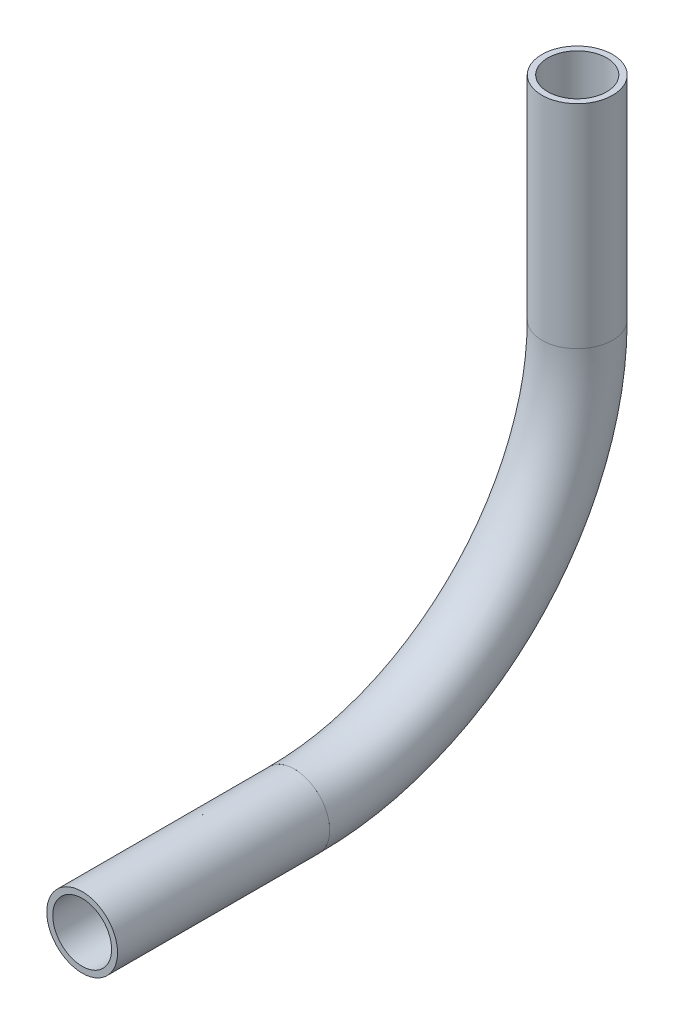
ISO-10303-21;
HEADER;
FILE_DESCRIPTION(('STEP AP214'),'2;1');
FILE_NAME('part.step','',(''),(''),'','','');
FILE_SCHEMA(('AUTOMOTIVE_DESIGN { 1 0 10303 214 1 1 1 1 }'));
ENDSEC;
DATA;
#1=APPLICATION_CONTEXT('core data for automotive mechanical design processes');
#2=APPLICATION_PROTOCOL_DEFINITION('international standard','automotive_design',2000,#1);
#3=PRODUCT_CONTEXT('',#1,'mechanical');
#4=PRODUCT('Part','Part','',(#3));
#5=PRODUCT_RELATED_PRODUCT_CATEGORY('part','',(#4));
#6=PRODUCT_DEFINITION_FORMATION('','',#4);
#7=PRODUCT_DEFINITION_CONTEXT('part definition',#1,'design');
#8=PRODUCT_DEFINITION('design','',#6,#7);
#9=PRODUCT_DEFINITION_SHAPE('','',#8);
#10=(LENGTH_UNIT() NAMED_UNIT(*) SI_UNIT(.MILLI.,.METRE.));
#11=(NAMED_UNIT(*) PLANE_ANGLE_UNIT() SI_UNIT($,.RADIAN.));
#12=(NAMED_UNIT(*) SI_UNIT($,.STERADIAN.) SOLID_ANGLE_UNIT());
#13=UNCERTAINTY_MEASURE_WITH_UNIT(LENGTH_MEASURE(1.E-05),#10,'distance_accuracy_value','');
#14=(GEOMETRIC_REPRESENTATION_CONTEXT(3) GLOBAL_UNCERTAINTY_ASSIGNED_CONTEXT((#13)) GLOBAL_UNIT_ASSIGNED_CONTEXT((#10,
#11,#12)) REPRESENTATION_CONTEXT('',''));
#15=CARTESIAN_POINT('',(0.,0.,0.));
#16=DIRECTION('',(0.,0.,1.));
#17=DIRECTION('',(1.,0.,0.));
#18=AXIS2_PLACEMENT_3D('',#15,#16,#17);
#19=CARTESIAN_POINT('',(0.,-165.173927777054,192.429076875495));
#20=DIRECTION('',(0.,1.,0.));
#21=DIRECTION('',(0.,0.,1.));
#22=AXIS2_PLACEMENT_3D('',#19,#20,#21);
#23=CYLINDRICAL_SURFACE('',#22,5.28319999999999);
#24=CARTESIAN_POINT('',(0.,-127.073927777054,192.429076875495));
#25=DIRECTION('',(0.,-1.,0.));
#26=DIRECTION('',(0.,0.,-1.));
#27=AXIS2_PLACEMENT_3D('',#24,#25,#26);
#28=CIRCLE('',#27,5.28319999999999);
#29=CARTESIAN_POINT('',(0.,-127.073927777054,187.145876875495));
#30=VERTEX_POINT('',#29);
#31=EDGE_CURVE('E67',#30,#30,#28,.T.);
#32=ORIENTED_EDGE('',*,*,#31,.F.);
#33=EDGE_LOOP('',(#32));
#34=FACE_BOUND('',#33,.T.);
#35=CARTESIAN_POINT('',(0.,-165.173927777054,192.429076875495));
#36=DIRECTION('',(0.,-1.,0.));
#37=DIRECTION('',(0.,0.,-1.));
#38=AXIS2_PLACEMENT_3D('',#35,#36,#37);
#39=CIRCLE('',#38,5.28319999999999);
#40=CARTESIAN_POINT('',(0.,-165.173927777054,187.145876875495));
#41=VERTEX_POINT('',#40);
#42=EDGE_CURVE('E63',#41,#41,#39,.T.);
#43=ORIENTED_EDGE('',*,*,#42,.T.);
#44=EDGE_LOOP('',(#43));
#45=FACE_BOUND('',#44,.T.);
#46=ADVANCED_FACE('F59',(#34,#45),#23,.F.);
#47=CARTESIAN_POINT('',(0.,-165.173927777054,192.429076875495));
#48=DIRECTION('',(0.,1.,0.));
#49=DIRECTION('',(0.,0.,1.));
#50=AXIS2_PLACEMENT_3D('',#47,#48,#49);
#51=CYLINDRICAL_SURFACE('',#50,6.35);
#52=CARTESIAN_POINT('',(0.,-127.073927777054,192.429076875495));
#53=DIRECTION('',(0.,-1.,0.));
#54=DIRECTION('',(0.,0.,-1.));
#55=AXIS2_PLACEMENT_3D('',#52,#53,#54);
#56=CIRCLE('',#55,6.35);
#57=CARTESIAN_POINT('',(0.,-127.073927777054,186.079076875495));
#58=VERTEX_POINT('',#57);
#59=EDGE_CURVE('E71',#58,#58,#56,.T.);
#60=ORIENTED_EDGE('',*,*,#59,.T.);
#61=EDGE_LOOP('',(#60));
#62=FACE_BOUND('',#61,.T.);
#63=CARTESIAN_POINT('',(0.,-165.173927777054,192.429076875495));
#64=DIRECTION('',(0.,-1.,0.));
#65=DIRECTION('',(0.,0.,-1.));
#66=AXIS2_PLACEMENT_3D('',#63,#64,#65);
#67=CIRCLE('',#66,6.35);
#68=CARTESIAN_POINT('',(0.,-165.173927777054,186.079076875495));
#69=VERTEX_POINT('',#68);
#70=EDGE_CURVE('E14',#69,#69,#67,.T.);
#71=ORIENTED_EDGE('',*,*,#70,.F.);
#72=EDGE_LOOP('',(#71));
#73=FACE_BOUND('',#72,.T.);
#74=ADVANCED_FACE('F86',(#62,#73),#51,.T.);
#75=CARTESIAN_POINT('',(0.,-127.073927777054,192.429076875495));
#76=DIRECTION('',(0.,-1.,0.));
#77=DIRECTION('',(0.,0.,-1.));
#78=AXIS2_PLACEMENT_3D('',#75,#76,#77);
#79=PLANE('',#78);
#80=ORIENTED_EDGE('',*,*,#31,.T.);
#81=EDGE_LOOP('',(#80));
#82=FACE_BOUND('',#81,.T.);
#83=ORIENTED_EDGE('',*,*,#59,.F.);
#84=EDGE_LOOP('',(#83));
#85=FACE_BOUND('',#84,.T.);
#86=ADVANCED_FACE('F82',(#82,#85),#79,.F.);
#87=CARTESIAN_POINT('',(0.,-165.173927777054,192.429076875495));
#88=DIRECTION('',(0.,-1.,0.));
#89=DIRECTION('',(0.,0.,-1.));
#90=AXIS2_PLACEMENT_3D('',#87,#88,#89);
#91=PLANE('',#90);
#92=ORIENTED_EDGE('',*,*,#42,.F.);
#93=EDGE_LOOP('',(#92));
#94=FACE_BOUND('',#93,.T.);
#95=ORIENTED_EDGE('',*,*,#70,.T.);
#96=EDGE_LOOP('',(#95));
#97=FACE_BOUND('',#96,.T.);
#98=ADVANCED_FACE('F61',(#94,#97),#91,.T.);
#99=CLOSED_SHELL('',(#46,#74,#86,#98));
#100=MANIFOLD_SOLID_BREP('B2',#99);
#101=CARTESIAN_POINT('',(0.,-165.173927777054,243.229076875495));
#102=DIRECTION('',(1.,0.,0.));
#103=DIRECTION('',(0.,0.,-1.));
#104=AXIS2_PLACEMENT_3D('',#101,#102,#103);
#105=TOROIDAL_SURFACE('',#104,50.8,5.28319999999999);
#106=CARTESIAN_POINT('',(0.,-215.973927777054,243.229076875495));
#107=DIRECTION('',(0.,0.,1.));
#108=DIRECTION('',(0.,-1.,0.));
#109=AXIS2_PLACEMENT_3D('',#106,#107,#108);
#110=CIRCLE('',#109,5.28319999999999);
#111=CARTESIAN_POINT('',(0.,-221.257127777054,243.229076875495));
#112=VERTEX_POINT('',#111);
#113=EDGE_CURVE('E168',#112,#112,#110,.T.);
#114=CARTESIAN_POINT('',(0.,-165.173927777054,192.429076875495));
#115=DIRECTION('',(0.,1.,0.));
#116=DIRECTION('',(0.,0.,1.));
#117=AXIS2_PLACEMENT_3D('',#114,#115,#116);
#118=CIRCLE('',#117,5.28319999999999);
#119=CARTESIAN_POINT('',(0.,-165.173927777054,187.145876875495));
#120=VERTEX_POINT('',#119);
#121=EDGE_CURVE('E158',#120,#120,#118,.T.);
#122=CARTESIAN_POINT('',(0.,-165.173927777054,243.229076875495));
#123=DIRECTION('',(1.,0.,0.));
#124=DIRECTION('',(0.,0.,-1.));
#125=AXIS2_PLACEMENT_3D('',#122,#123,#124);
#126=CIRCLE('',#125,56.0831999999999);
#127=EDGE_CURVE('',#112,#120,#126,.T.);
#128=ORIENTED_EDGE('',*,*,#113,.T.);
#129=ORIENTED_EDGE('',*,*,#121,.T.);
#130=ORIENTED_EDGE('',*,*,#127,.T.);
#131=ORIENTED_EDGE('',*,*,#127,.F.);
#132=EDGE_LOOP('',(#128,#130,#129,#131));
#133=FACE_BOUND('',#132,.T.);
#134=ADVANCED_FACE('F154',(#133),#105,.F.);
#135=CARTESIAN_POINT('',(0.,-165.173927777054,243.229076875495));
#136=DIRECTION('',(1.,0.,0.));
#137=DIRECTION('',(0.,0.,-1.));
#138=AXIS2_PLACEMENT_3D('',#135,#136,#137);
#139=TOROIDAL_SURFACE('',#138,50.8,6.35);
#140=CARTESIAN_POINT('',(0.,-215.973927777054,243.229076875495));
#141=DIRECTION('',(0.,0.,1.));
#142=DIRECTION('',(0.,-1.,0.));
#143=AXIS2_PLACEMENT_3D('',#140,#141,#142);
#144=CIRCLE('',#143,6.35);
#145=CARTESIAN_POINT('',(0.,-222.323927777054,243.229076875495));
#146=VERTEX_POINT('',#145);
#147=EDGE_CURVE('E162',#146,#146,#144,.T.);
#148=CARTESIAN_POINT('',(0.,-165.173927777054,192.429076875495));
#149=DIRECTION('',(0.,1.,0.));
#150=DIRECTION('',(0.,0.,1.));
#151=AXIS2_PLACEMENT_3D('',#148,#149,#150);
#152=CIRCLE('',#151,6.35);
#153=CARTESIAN_POINT('',(0.,-165.173927777054,186.079076875495));
#154=VERTEX_POINT('',#153);
#155=EDGE_CURVE('E58',#154,#154,#152,.T.);
#156=CARTESIAN_POINT('',(0.,-165.173927777054,243.229076875495));
#157=DIRECTION('',(1.,0.,0.));
#158=DIRECTION('',(0.,0.,-1.));
#159=AXIS2_PLACEMENT_3D('',#156,#157,#158);
#160=CIRCLE('',#159,57.1499999999999);
#161=EDGE_CURVE('',#146,#154,#160,.T.);
#162=ORIENTED_EDGE('',*,*,#147,.F.);
#163=ORIENTED_EDGE('',*,*,#155,.F.);
#164=ORIENTED_EDGE('',*,*,#161,.T.);
#165=ORIENTED_EDGE('',*,*,#161,.F.);
#166=EDGE_LOOP('',(#162,#164,#163,#165));
#167=FACE_BOUND('',#166,.T.);
#168=ADVANCED_FACE('F181',(#167),#139,.T.);
#169=CARTESIAN_POINT('',(0.,-215.973927777054,243.229076875495));
#170=DIRECTION('',(0.,0.,1.));
#171=DIRECTION('',(0.,-1.,0.));
#172=AXIS2_PLACEMENT_3D('',#169,#170,#171);
#173=PLANE('',#172);
#174=ORIENTED_EDGE('',*,*,#113,.F.);
#175=EDGE_LOOP('',(#174));
#176=FACE_BOUND('',#175,.T.);
#177=ORIENTED_EDGE('',*,*,#147,.T.);
#178=EDGE_LOOP('',(#177));
#179=FACE_BOUND('',#178,.T.);
#180=ADVANCED_FACE('F177',(#176,#179),#173,.T.);
#181=CARTESIAN_POINT('',(0.,-165.173927777054,192.429076875495));
#182=DIRECTION('',(0.,1.,0.));
#183=DIRECTION('',(0.,0.,1.));
#184=AXIS2_PLACEMENT_3D('',#181,#182,#183);
#185=PLANE('',#184);
#186=ORIENTED_EDGE('',*,*,#121,.F.);
#187=EDGE_LOOP('',(#186));
#188=FACE_BOUND('',#187,.T.);
#189=ORIENTED_EDGE('',*,*,#155,.T.);
#190=EDGE_LOOP('',(#189));
#191=FACE_BOUND('',#190,.T.);
#192=ADVANCED_FACE('F156',(#188,#191),#185,.T.);
#193=CLOSED_SHELL('',(#134,#168,#180,#192));
#194=MANIFOLD_SOLID_BREP('B9',#193);
#195=CARTESIAN_POINT('',(0.,-215.973927777054,281.329076875495));
#196=DIRECTION('',(0.,0.,-1.));
#197=DIRECTION('',(-1.,0.,0.));
#198=AXIS2_PLACEMENT_3D('',#195,#196,#197);
#199=CYLINDRICAL_SURFACE('',#198,5.28319999999999);
#200=CARTESIAN_POINT('',(0.,-215.973927777054,281.329076875495));
#201=DIRECTION('',(0.,0.,1.));
#202=DIRECTION('',(0.,-1.,0.));
#203=AXIS2_PLACEMENT_3D('',#200,#201,#202);
#204=CIRCLE('',#203,5.28319999999999);
#205=CARTESIAN_POINT('',(0.,-221.257127777054,281.329076875495));
#206=VERTEX_POINT('',#205);
#207=EDGE_CURVE('E256',#206,#206,#204,.T.);
#208=ORIENTED_EDGE('',*,*,#207,.T.);
#209=EDGE_LOOP('',(#208));
#210=FACE_BOUND('',#209,.T.);
#211=CARTESIAN_POINT('',(0.,-215.973927777054,243.229076875495));
#212=DIRECTION('',(0.,0.,-1.));
#213=DIRECTION('',(0.,1.,0.));
#214=AXIS2_PLACEMENT_3D('',#211,#212,#213);
#215=CIRCLE('',#214,5.28319999999999);
#216=CARTESIAN_POINT('',(0.,-210.690727777054,243.229076875495));
#217=VERTEX_POINT('',#216);
#218=EDGE_CURVE('E246',#217,#217,#215,.T.);
#219=ORIENTED_EDGE('',*,*,#218,.T.);
#220=EDGE_LOOP('',(#219));
#221=FACE_BOUND('',#220,.T.);
#222=ADVANCED_FACE('F242',(#210,#221),#199,.F.);
#223=CARTESIAN_POINT('',(0.,-215.973927777054,281.329076875495));
#224=DIRECTION('',(0.,0.,-1.));
#225=DIRECTION('',(-1.,0.,0.));
#226=AXIS2_PLACEMENT_3D('',#223,#224,#225);
#227=CYLINDRICAL_SURFACE('',#226,6.35);
#228=CARTESIAN_POINT('',(0.,-215.973927777054,281.329076875495));
#229=DIRECTION('',(0.,0.,1.));
#230=DIRECTION('',(0.,-1.,0.));
#231=AXIS2_PLACEMENT_3D('',#228,#229,#230);
#232=CIRCLE('',#231,6.35);
#233=CARTESIAN_POINT('',(0.,-222.323927777054,281.329076875495));
#234=VERTEX_POINT('',#233);
#235=EDGE_CURVE('E250',#234,#234,#232,.T.);
#236=ORIENTED_EDGE('',*,*,#235,.F.);
#237=EDGE_LOOP('',(#236));
#238=FACE_BOUND('',#237,.T.);
#239=CARTESIAN_POINT('',(0.,-215.973927777054,243.229076875495));
#240=DIRECTION('',(0.,0.,-1.));
#241=DIRECTION('',(0.,1.,0.));
#242=AXIS2_PLACEMENT_3D('',#239,#240,#241);
#243=CIRCLE('',#242,6.35);
#244=CARTESIAN_POINT('',(0.,-209.623927777054,243.229076875495));
#245=VERTEX_POINT('',#244);
#246=EDGE_CURVE('E153',#245,#245,#243,.T.);
#247=ORIENTED_EDGE('',*,*,#246,.F.);
#248=EDGE_LOOP('',(#247));
#249=FACE_BOUND('',#248,.T.);
#250=ADVANCED_FACE('F269',(#238,#249),#227,.T.);
#251=CARTESIAN_POINT('',(0.,-215.973927777054,281.329076875495));
#252=DIRECTION('',(0.,0.,1.));
#253=DIRECTION('',(0.,-1.,0.));
#254=AXIS2_PLACEMENT_3D('',#251,#252,#253);
#255=PLANE('',#254);
#256=ORIENTED_EDGE('',*,*,#207,.F.);
#257=EDGE_LOOP('',(#256));
#258=FACE_BOUND('',#257,.T.);
#259=ORIENTED_EDGE('',*,*,#235,.T.);
#260=EDGE_LOOP('',(#259));
#261=FACE_BOUND('',#260,.T.);
#262=ADVANCED_FACE('F265',(#258,#261),#255,.T.);
#263=CARTESIAN_POINT('',(0.,-215.973927777054,243.229076875495));
#264=DIRECTION('',(0.,0.,-1.));
#265=DIRECTION('',(0.,1.,0.));
#266=AXIS2_PLACEMENT_3D('',#263,#264,#265);
#267=PLANE('',#266);
#268=ORIENTED_EDGE('',*,*,#218,.F.);
#269=EDGE_LOOP('',(#268));
#270=FACE_BOUND('',#269,.T.);
#271=ORIENTED_EDGE('',*,*,#246,.T.);
#272=EDGE_LOOP('',(#271));
#273=FACE_BOUND('',#272,.T.);
#274=ADVANCED_FACE('F244',(#270,#273),#267,.T.);
#275=CLOSED_SHELL('',(#222,#250,#262,#274));
#276=MANIFOLD_SOLID_BREP('B53',#275);
#277=ADVANCED_BREP_SHAPE_REPRESENTATION('',(#18,#100,#194,#276),#14);
#278=SHAPE_DEFINITION_REPRESENTATION(#9,#277);
ENDSEC;
END-ISO-10303-21;
